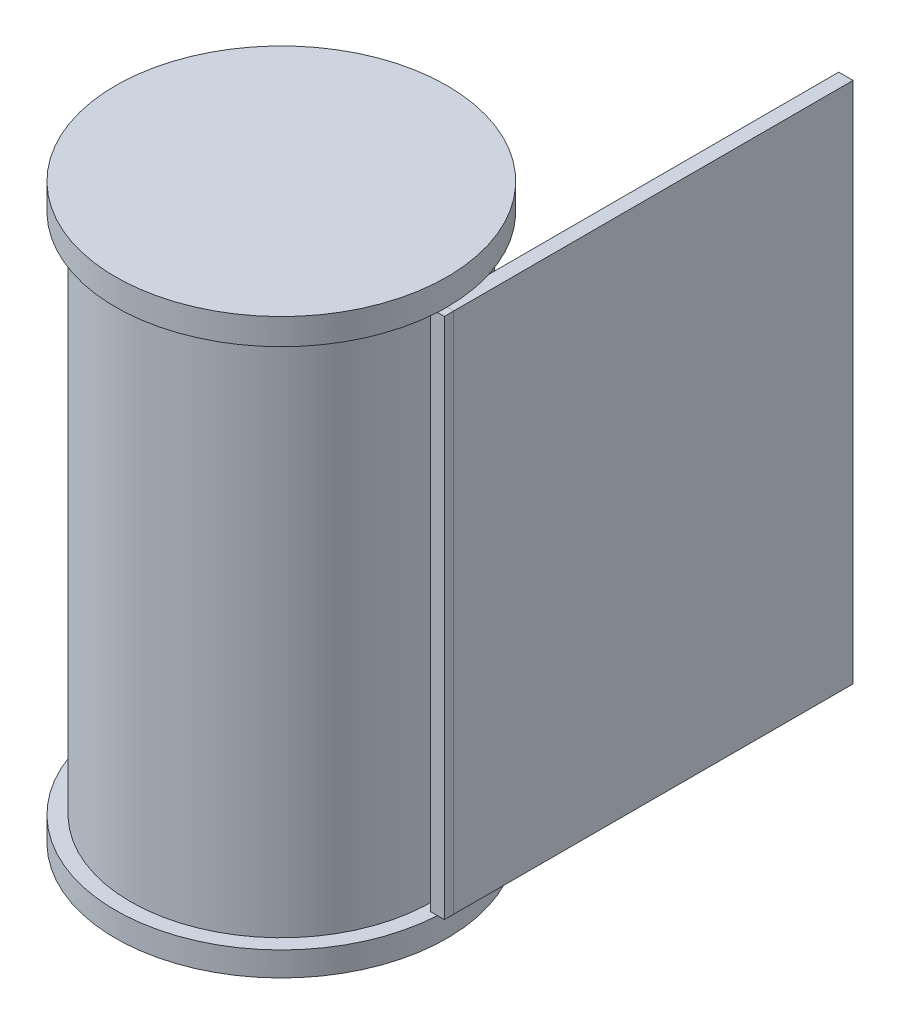
ISO-10303-21;
HEADER;
FILE_DESCRIPTION(('STEP AP214'),'2;1');
FILE_NAME('part.step','',(''),(''),'','','');
FILE_SCHEMA(('AUTOMOTIVE_DESIGN { 1 0 10303 214 1 1 1 1 }'));
ENDSEC;
DATA;
#1=APPLICATION_CONTEXT('core data for automotive mechanical design processes');
#2=APPLICATION_PROTOCOL_DEFINITION('international standard','automotive_design',2000,#1);
#3=PRODUCT_CONTEXT('',#1,'mechanical');
#4=PRODUCT('Part','Part','',(#3));
#5=PRODUCT_RELATED_PRODUCT_CATEGORY('part','',(#4));
#6=PRODUCT_DEFINITION_FORMATION('','',#4);
#7=PRODUCT_DEFINITION_CONTEXT('part definition',#1,'design');
#8=PRODUCT_DEFINITION('design','',#6,#7);
#9=PRODUCT_DEFINITION_SHAPE('','',#8);
#10=(LENGTH_UNIT() NAMED_UNIT(*) SI_UNIT(.MILLI.,.METRE.));
#11=(NAMED_UNIT(*) PLANE_ANGLE_UNIT() SI_UNIT($,.RADIAN.));
#12=(NAMED_UNIT(*) SI_UNIT($,.STERADIAN.) SOLID_ANGLE_UNIT());
#13=UNCERTAINTY_MEASURE_WITH_UNIT(LENGTH_MEASURE(1.E-05),#10,'distance_accuracy_value','');
#14=(GEOMETRIC_REPRESENTATION_CONTEXT(3) GLOBAL_UNCERTAINTY_ASSIGNED_CONTEXT((#13)) GLOBAL_UNIT_ASSIGNED_CONTEXT((#10,
#11,#12)) REPRESENTATION_CONTEXT('',''));
#15=CARTESIAN_POINT('',(0.,0.,0.));
#16=DIRECTION('',(0.,0.,1.));
#17=DIRECTION('',(1.,0.,0.));
#18=AXIS2_PLACEMENT_3D('',#15,#16,#17);
#19=CARTESIAN_POINT('',(0.,-64.2446613956254,0.));
#20=DIRECTION('',(0.,1.,0.));
#21=DIRECTION('',(0.,0.,1.));
#22=AXIS2_PLACEMENT_3D('',#19,#20,#21);
#23=PLANE('',#22);
#24=CARTESIAN_POINT('',(0.,-64.2446613956254,0.));
#25=DIRECTION('',(0.,-1.,0.));
#26=DIRECTION('',(0.,0.,-1.));
#27=AXIS2_PLACEMENT_3D('',#24,#25,#26);
#28=CIRCLE('',#27,32.1131733876922);
#29=CARTESIAN_POINT('',(0.,-64.2446613956254,-32.1131733876922));
#30=VERTEX_POINT('',#29);
#31=EDGE_CURVE('E185',#30,#30,#28,.T.);
#32=ORIENTED_EDGE('',*,*,#31,.T.);
#33=EDGE_LOOP('',(#32));
#34=FACE_BOUND('',#33,.T.);
#35=DIRECTION('',(1.,0.,0.));
#36=VECTOR('',#35,1.);
#37=CARTESIAN_POINT('',(36.7117632695279,-64.2446613956254,2.));
#38=LINE('',#37,#36);
#39=CARTESIAN_POINT('',(33.7117632695279,-64.2446613956254,2.));
#40=VERTEX_POINT('',#39);
#41=CARTESIAN_POINT('',(35.2346998319741,-64.2446613956254,2.));
#42=VERTEX_POINT('',#41);
#43=EDGE_CURVE('E60',#40,#42,#38,.T.);
#44=ORIENTED_EDGE('',*,*,#43,.F.);
#45=DIRECTION('',(0.,0.,-1.));
#46=VECTOR('',#45,1.);
#47=CARTESIAN_POINT('',(33.7117632695279,-64.2446613956254,2.));
#48=LINE('',#47,#46);
#49=CARTESIAN_POINT('',(33.7117632695279,-64.2446613956254,0.));
#50=VERTEX_POINT('',#49);
#51=EDGE_CURVE('E151',#40,#50,#48,.T.);
#52=ORIENTED_EDGE('',*,*,#51,.T.);
#53=DIRECTION('',(0.000314159260191267,0.,0.999999950651978));
#54=VECTOR('',#53,1.);
#55=CARTESIAN_POINT('',(33.7117599423104,-64.2446613956254,-0.0105908620858599));
#56=LINE('',#55,#54);
#57=CARTESIAN_POINT('',(33.7084800052616,-64.2446613956254,-10.4509544054214));
#58=VERTEX_POINT('',#57);
#59=EDGE_CURVE('E163',#58,#50,#56,.T.);
#60=ORIENTED_EDGE('',*,*,#59,.F.);
#61=CARTESIAN_POINT('',(0.,-64.2446613956254,0.));
#62=DIRECTION('',(0.,-1.,0.));
#63=DIRECTION('',(0.,0.,-1.));
#64=AXIS2_PLACEMENT_3D('',#61,#62,#63);
#65=CIRCLE('',#64,35.2914164103585);
#66=EDGE_CURVE('E188',#42,#58,#65,.T.);
#67=ORIENTED_EDGE('',*,*,#66,.F.);
#68=EDGE_LOOP('',(#44,#52,#60,#67));
#69=FACE_BOUND('',#68,.T.);
#70=ADVANCED_FACE('F37',(#34,#69),#23,.T.);
#71=CARTESIAN_POINT('',(0.,46.993844397693,0.));
#72=DIRECTION('',(0.,-1.,0.));
#73=DIRECTION('',(0.,0.,-1.));
#74=AXIS2_PLACEMENT_3D('',#71,#72,#73);
#75=PLANE('',#74);
#76=CARTESIAN_POINT('',(0.,46.993844397693,0.));
#77=DIRECTION('',(0.,-1.,0.));
#78=DIRECTION('',(0.,0.,-1.));
#79=AXIS2_PLACEMENT_3D('',#76,#77,#78);
#80=CIRCLE('',#79,32.1131733876922);
#81=CARTESIAN_POINT('',(0.,46.993844397693,-32.1131733876922));
#82=VERTEX_POINT('',#81);
#83=EDGE_CURVE('E182',#82,#82,#80,.T.);
#84=ORIENTED_EDGE('',*,*,#83,.F.);
#85=EDGE_LOOP('',(#84));
#86=FACE_BOUND('',#85,.T.);
#87=DIRECTION('',(-0.000314159260191267,0.,-0.999999950651978));
#88=VECTOR('',#87,1.);
#89=CARTESIAN_POINT('',(33.7117599423104,46.993844397693,-0.0105908620858599));
#90=LINE('',#89,#88);
#91=CARTESIAN_POINT('',(33.7117632695279,46.993844397693,0.));
#92=VERTEX_POINT('',#91);
#93=CARTESIAN_POINT('',(33.7084800052616,46.993844397693,-10.4509544054214));
#94=VERTEX_POINT('',#93);
#95=EDGE_CURVE('E160',#92,#94,#90,.T.);
#96=ORIENTED_EDGE('',*,*,#95,.F.);
#97=DIRECTION('',(0.,0.,-1.));
#98=VECTOR('',#97,1.);
#99=CARTESIAN_POINT('',(33.7117632695279,46.993844397693,2.));
#100=LINE('',#99,#98);
#101=CARTESIAN_POINT('',(33.7117632695279,46.993844397693,2.));
#102=VERTEX_POINT('',#101);
#103=EDGE_CURVE('E154',#102,#92,#100,.T.);
#104=ORIENTED_EDGE('',*,*,#103,.F.);
#105=DIRECTION('',(-1.,0.,0.));
#106=VECTOR('',#105,1.);
#107=CARTESIAN_POINT('',(33.7117632695279,46.993844397693,2.));
#108=LINE('',#107,#106);
#109=CARTESIAN_POINT('',(35.2346998319741,46.993844397693,2.));
#110=VERTEX_POINT('',#109);
#111=EDGE_CURVE('E147',#110,#102,#108,.T.);
#112=ORIENTED_EDGE('',*,*,#111,.F.);
#113=CARTESIAN_POINT('',(0.,46.993844397693,0.));
#114=DIRECTION('',(0.,-1.,0.));
#115=DIRECTION('',(0.,0.,-1.));
#116=AXIS2_PLACEMENT_3D('',#113,#114,#115);
#117=CIRCLE('',#116,35.2914164103585);
#118=EDGE_CURVE('E178',#110,#94,#117,.T.);
#119=ORIENTED_EDGE('',*,*,#118,.T.);
#120=EDGE_LOOP('',(#96,#104,#112,#119));
#121=FACE_BOUND('',#120,.T.);
#122=ADVANCED_FACE('F241',(#86,#121),#75,.T.);
#123=CARTESIAN_POINT('',(0.,52.5557696873589,0.));
#124=DIRECTION('',(0.,1.,0.));
#125=DIRECTION('',(0.,0.,1.));
#126=AXIS2_PLACEMENT_3D('',#123,#124,#125);
#127=PLANE('',#126);
#128=CARTESIAN_POINT('',(0.,52.5557696873589,0.));
#129=DIRECTION('',(0.,-1.,0.));
#130=DIRECTION('',(0.,0.,-1.));
#131=AXIS2_PLACEMENT_3D('',#128,#129,#130);
#132=CIRCLE('',#131,35.2914164103585);
#133=CARTESIAN_POINT('',(0.,52.5557696873589,-35.2914164103585));
#134=VERTEX_POINT('',#133);
#135=EDGE_CURVE('E175',#134,#134,#132,.T.);
#136=ORIENTED_EDGE('',*,*,#135,.F.);
#137=EDGE_LOOP('',(#136));
#138=FACE_BOUND('',#137,.T.);
#139=ADVANCED_FACE('F39',(#138),#127,.T.);
#140=CARTESIAN_POINT('',(0.,-69.409306307458,0.));
#141=DIRECTION('',(0.,-1.,0.));
#142=DIRECTION('',(0.,0.,-1.));
#143=AXIS2_PLACEMENT_3D('',#140,#141,#142);
#144=PLANE('',#143);
#145=CARTESIAN_POINT('',(0.,-69.409306307458,0.));
#146=DIRECTION('',(0.,-1.,0.));
#147=DIRECTION('',(0.,0.,-1.));
#148=AXIS2_PLACEMENT_3D('',#145,#146,#147);
#149=CIRCLE('',#148,22.1131733876922);
#150=CARTESIAN_POINT('',(0.,-69.409306307458,-22.1131733876922));
#151=VERTEX_POINT('',#150);
#152=EDGE_CURVE('E172',#151,#151,#149,.F.);
#153=ORIENTED_EDGE('',*,*,#152,.T.);
#154=EDGE_LOOP('',(#153));
#155=FACE_BOUND('',#154,.T.);
#156=CARTESIAN_POINT('',(0.,-69.409306307458,0.));
#157=DIRECTION('',(0.,-1.,0.));
#158=DIRECTION('',(0.,0.,-1.));
#159=AXIS2_PLACEMENT_3D('',#156,#157,#158);
#160=CIRCLE('',#159,35.2914164103585);
#161=CARTESIAN_POINT('',(0.,-69.409306307458,-35.2914164103585));
#162=VERTEX_POINT('',#161);
#163=EDGE_CURVE('E190',#162,#162,#160,.T.);
#164=ORIENTED_EDGE('',*,*,#163,.T.);
#165=EDGE_LOOP('',(#164));
#166=FACE_BOUND('',#165,.T.);
#167=ADVANCED_FACE('F268',(#155,#166),#144,.T.);
#168=CARTESIAN_POINT('',(0.,-77.4814163002232,0.));
#169=DIRECTION('',(0.,-1.,0.));
#170=DIRECTION('',(0.,0.,-1.));
#171=AXIS2_PLACEMENT_3D('',#168,#169,#170);
#172=CYLINDRICAL_SURFACE('',#171,35.2914164103585);
#173=CARTESIAN_POINT('',(0.,-64.2446613956254,0.));
#174=DIRECTION('',(0.,-0.999999950651978,0.000314159260191267));
#175=DIRECTION('',(0.,-0.000314159260191267,-0.999999950651978));
#176=AXIS2_PLACEMENT_3D('',#173,#174,#175);
#177=ELLIPSE('',#176,35.2914181519201,35.2914164103585);
#178=CARTESIAN_POINT('',(35.2914164103585,-64.2446613956254,0.));
#179=VERTEX_POINT('',#178);
#180=CARTESIAN_POINT('',(33.7084800052616,-64.2479446598917,-10.4509544054214));
#181=VERTEX_POINT('',#180);
#182=EDGE_CURVE('E167',#179,#181,#177,.F.);
#183=ORIENTED_EDGE('',*,*,#182,.F.);
#184=EDGE_CURVE('E124',#179,#42,#65,.T.);
#185=ORIENTED_EDGE('',*,*,#184,.T.);
#186=ORIENTED_EDGE('',*,*,#66,.T.);
#187=DIRECTION('',(0.,-1.,0.));
#188=VECTOR('',#187,1.);
#189=CARTESIAN_POINT('',(33.7084800052616,-77.4814163002232,-10.4509544054214));
#190=LINE('',#189,#188);
#191=EDGE_CURVE('E52',#181,#58,#190,.F.);
#192=ORIENTED_EDGE('',*,*,#191,.F.);
#193=EDGE_LOOP('',(#183,#185,#186,#192));
#194=FACE_BOUND('',#193,.T.);
#195=ORIENTED_EDGE('',*,*,#163,.F.);
#196=EDGE_LOOP('',(#195));
#197=FACE_BOUND('',#196,.T.);
#198=ADVANCED_FACE('F234',(#194,#197),#172,.T.);
#199=CARTESIAN_POINT('',(0.,-77.4814163002232,0.));
#200=DIRECTION('',(0.,-1.,0.));
#201=DIRECTION('',(0.,0.,-1.));
#202=AXIS2_PLACEMENT_3D('',#199,#200,#201);
#203=CYLINDRICAL_SURFACE('',#202,32.1131733876922);
#204=ORIENTED_EDGE('',*,*,#83,.T.);
#205=EDGE_LOOP('',(#204));
#206=FACE_BOUND('',#205,.T.);
#207=ORIENTED_EDGE('',*,*,#31,.F.);
#208=EDGE_LOOP('',(#207));
#209=FACE_BOUND('',#208,.T.);
#210=ADVANCED_FACE('F266',(#206,#209),#203,.T.);
#211=CARTESIAN_POINT('',(0.,-77.4814163002232,0.));
#212=DIRECTION('',(0.,-1.,0.));
#213=DIRECTION('',(0.,0.,-1.));
#214=AXIS2_PLACEMENT_3D('',#211,#212,#213);
#215=CYLINDRICAL_SURFACE('',#214,35.2914164103585);
#216=CARTESIAN_POINT('',(0.,46.993844397693,0.));
#217=DIRECTION('',(0.,0.999999950651978,0.000314159260191267));
#218=DIRECTION('',(0.,-0.000314159260191267,0.999999950651978));
#219=AXIS2_PLACEMENT_3D('',#216,#217,#218);
#220=ELLIPSE('',#219,35.2914181519201,35.2914164103585);
#221=CARTESIAN_POINT('',(33.7084800052616,46.9971276619594,-10.4509544054214));
#222=VERTEX_POINT('',#221);
#223=CARTESIAN_POINT('',(35.2914164103585,46.993844397693,0.));
#224=VERTEX_POINT('',#223);
#225=EDGE_CURVE('E11',#222,#224,#220,.F.);
#226=ORIENTED_EDGE('',*,*,#225,.F.);
#227=DIRECTION('',(0.,-1.,0.));
#228=VECTOR('',#227,1.);
#229=CARTESIAN_POINT('',(33.7084800052616,-77.4814163002232,-10.4509544054214));
#230=LINE('',#229,#228);
#231=EDGE_CURVE('E45',#94,#222,#230,.F.);
#232=ORIENTED_EDGE('',*,*,#231,.F.);
#233=ORIENTED_EDGE('',*,*,#118,.F.);
#234=EDGE_CURVE('E181',#224,#110,#117,.T.);
#235=ORIENTED_EDGE('',*,*,#234,.F.);
#236=EDGE_LOOP('',(#226,#232,#233,#235));
#237=FACE_BOUND('',#236,.T.);
#238=ORIENTED_EDGE('',*,*,#135,.T.);
#239=EDGE_LOOP('',(#238));
#240=FACE_BOUND('',#239,.T.);
#241=ADVANCED_FACE('F243',(#237,#240),#215,.T.);
#242=CARTESIAN_POINT('',(0.,-77.4814163002232,0.));
#243=DIRECTION('',(0.,-1.,0.));
#244=DIRECTION('',(0.,0.,-1.));
#245=AXIS2_PLACEMENT_3D('',#242,#243,#244);
#246=CYLINDRICAL_SURFACE('',#245,22.1131733876922);
#247=CARTESIAN_POINT('',(0.,42.5557696873589,0.));
#248=DIRECTION('',(0.,1.,0.));
#249=DIRECTION('',(0.,0.,1.));
#250=AXIS2_PLACEMENT_3D('',#247,#248,#249);
#251=CIRCLE('',#250,22.1131733876922);
#252=CARTESIAN_POINT('',(0.,42.5557696873589,22.1131733876922));
#253=VERTEX_POINT('',#252);
#254=EDGE_CURVE('E169',#253,#253,#251,.T.);
#255=ORIENTED_EDGE('',*,*,#254,.T.);
#256=EDGE_LOOP('',(#255));
#257=FACE_BOUND('',#256,.T.);
#258=ORIENTED_EDGE('',*,*,#152,.F.);
#259=EDGE_LOOP('',(#258));
#260=FACE_BOUND('',#259,.T.);
#261=ADVANCED_FACE('F279',(#257,#260),#246,.F.);
#262=CARTESIAN_POINT('',(0.,42.5557696873589,0.));
#263=DIRECTION('',(0.,1.,0.));
#264=DIRECTION('',(0.,0.,1.));
#265=AXIS2_PLACEMENT_3D('',#262,#263,#264);
#266=PLANE('',#265);
#267=ORIENTED_EDGE('',*,*,#254,.F.);
#268=EDGE_LOOP('',(#267));
#269=FACE_BOUND('',#268,.T.);
#270=ADVANCED_FACE('F281',(#269),#266,.F.);
#271=CARTESIAN_POINT('',(33.7117632695279,46.993844397693,2.));
#272=DIRECTION('',(0.,-1.,0.));
#273=DIRECTION('',(0.,0.,-1.));
#274=AXIS2_PLACEMENT_3D('',#271,#272,#273);
#275=PLANE('',#274);
#276=ORIENTED_EDGE('',*,*,#234,.T.);
#277=CARTESIAN_POINT('',(36.7117632695279,46.993844397693,2.));
#278=VERTEX_POINT('',#277);
#279=EDGE_CURVE('E219',#278,#110,#108,.T.);
#280=ORIENTED_EDGE('',*,*,#279,.F.);
#281=DIRECTION('',(0.,0.,-1.));
#282=VECTOR('',#281,1.);
#283=CARTESIAN_POINT('',(36.7117632695279,46.993844397693,2.));
#284=LINE('',#283,#282);
#285=CARTESIAN_POINT('',(36.7117632695279,46.993844397693,0.));
#286=VERTEX_POINT('',#285);
#287=EDGE_CURVE('E152',#278,#286,#284,.T.);
#288=ORIENTED_EDGE('',*,*,#287,.T.);
#289=DIRECTION('',(-1.,0.,0.));
#290=VECTOR('',#289,1.);
#291=CARTESIAN_POINT('',(33.7117632695279,46.993844397693,0.));
#292=LINE('',#291,#290);
#293=EDGE_CURVE('E227',#286,#224,#292,.T.);
#294=ORIENTED_EDGE('',*,*,#293,.T.);
#295=EDGE_LOOP('',(#276,#280,#288,#294));
#296=FACE_BOUND('',#295,.T.);
#297=ADVANCED_FACE('F246',(#296),#275,.F.);
#298=CARTESIAN_POINT('',(33.7117632695279,46.993844397693,2.));
#299=DIRECTION('',(1.,0.,0.));
#300=DIRECTION('',(0.,1.,0.));
#301=AXIS2_PLACEMENT_3D('',#298,#299,#300);
#302=PLANE('',#301);
#303=DIRECTION('',(0.,-1.,0.));
#304=VECTOR('',#303,1.);
#305=CARTESIAN_POINT('',(33.7117632695279,46.993844397693,0.));
#306=LINE('',#305,#304);
#307=EDGE_CURVE('E127',#92,#50,#306,.T.);
#308=ORIENTED_EDGE('',*,*,#307,.T.);
#309=ORIENTED_EDGE('',*,*,#51,.F.);
#310=DIRECTION('',(0.,-1.,0.));
#311=VECTOR('',#310,1.);
#312=CARTESIAN_POINT('',(33.7117632695279,46.993844397693,2.));
#313=LINE('',#312,#311);
#314=EDGE_CURVE('E222',#102,#40,#313,.T.);
#315=ORIENTED_EDGE('',*,*,#314,.F.);
#316=ORIENTED_EDGE('',*,*,#103,.T.);
#317=EDGE_LOOP('',(#308,#309,#315,#316));
#318=FACE_BOUND('',#317,.T.);
#319=ADVANCED_FACE('F232',(#318),#302,.F.);
#320=CARTESIAN_POINT('',(36.7117632695279,-64.2446613956254,2.));
#321=DIRECTION('',(0.,1.,0.));
#322=DIRECTION('',(0.,0.,1.));
#323=AXIS2_PLACEMENT_3D('',#320,#321,#322);
#324=PLANE('',#323);
#325=ORIENTED_EDGE('',*,*,#184,.F.);
#326=DIRECTION('',(1.,0.,0.));
#327=VECTOR('',#326,1.);
#328=CARTESIAN_POINT('',(36.7117632695279,-64.2446613956254,0.));
#329=LINE('',#328,#327);
#330=CARTESIAN_POINT('',(36.7117632695279,-64.2446613956254,0.));
#331=VERTEX_POINT('',#330);
#332=EDGE_CURVE('E116',#179,#331,#329,.T.);
#333=ORIENTED_EDGE('',*,*,#332,.T.);
#334=DIRECTION('',(0.,0.,-1.));
#335=VECTOR('',#334,1.);
#336=CARTESIAN_POINT('',(36.7117632695279,-64.2446613956254,2.));
#337=LINE('',#336,#335);
#338=CARTESIAN_POINT('',(36.7117632695279,-64.2446613956254,2.));
#339=VERTEX_POINT('',#338);
#340=EDGE_CURVE('E121',#339,#331,#337,.T.);
#341=ORIENTED_EDGE('',*,*,#340,.F.);
#342=EDGE_CURVE('E224',#42,#339,#38,.T.);
#343=ORIENTED_EDGE('',*,*,#342,.F.);
#344=EDGE_LOOP('',(#325,#333,#341,#343));
#345=FACE_BOUND('',#344,.T.);
#346=ADVANCED_FACE('F118',(#345),#324,.F.);
#347=CARTESIAN_POINT('',(36.7117632695279,46.993844397693,2.));
#348=DIRECTION('',(-1.,0.,0.));
#349=DIRECTION('',(0.,-1.,0.));
#350=AXIS2_PLACEMENT_3D('',#347,#348,#349);
#351=PLANE('',#350);
#352=DIRECTION('',(0.,1.,0.));
#353=VECTOR('',#352,1.);
#354=CARTESIAN_POINT('',(36.7117632695279,46.993844397693,0.));
#355=LINE('',#354,#353);
#356=EDGE_CURVE('E126',#331,#286,#355,.T.);
#357=ORIENTED_EDGE('',*,*,#356,.T.);
#358=ORIENTED_EDGE('',*,*,#287,.F.);
#359=DIRECTION('',(0.,1.,0.));
#360=VECTOR('',#359,1.);
#361=CARTESIAN_POINT('',(36.7117632695279,46.993844397693,2.));
#362=LINE('',#361,#360);
#363=EDGE_CURVE('E150',#339,#278,#362,.T.);
#364=ORIENTED_EDGE('',*,*,#363,.F.);
#365=ORIENTED_EDGE('',*,*,#340,.T.);
#366=EDGE_LOOP('',(#357,#358,#364,#365));
#367=FACE_BOUND('',#366,.T.);
#368=ADVANCED_FACE('F149',(#367),#351,.F.);
#369=CARTESIAN_POINT('',(0.,0.,2.));
#370=DIRECTION('',(0.,0.,-1.));
#371=DIRECTION('',(-1.,0.,0.));
#372=AXIS2_PLACEMENT_3D('',#369,#370,#371);
#373=PLANE('',#372);
#374=ORIENTED_EDGE('',*,*,#279,.T.);
#375=ORIENTED_EDGE('',*,*,#111,.T.);
#376=ORIENTED_EDGE('',*,*,#314,.T.);
#377=ORIENTED_EDGE('',*,*,#43,.T.);
#378=ORIENTED_EDGE('',*,*,#342,.T.);
#379=ORIENTED_EDGE('',*,*,#363,.T.);
#380=EDGE_LOOP('',(#374,#375,#376,#377,#378,#379));
#381=FACE_BOUND('',#380,.T.);
#382=ADVANCED_FACE('F237',(#381),#373,.F.);
#383=CARTESIAN_POINT('',(33.7117632695279,46.993844397693,0.));
#384=DIRECTION('',(0.,0.999999950651978,0.000314159260191267));
#385=DIRECTION('',(0.,-0.000314159260191267,0.999999950651978));
#386=AXIS2_PLACEMENT_3D('',#383,#384,#385);
#387=PLANE('',#386);
#388=DIRECTION('',(0.000314159244688131,-0.000314159244688131,0.999999901303964));
#389=VECTOR('',#388,1.);
#390=CARTESIAN_POINT('',(33.7117632695279,46.993844397693,0.));
#391=LINE('',#390,#389);
#392=CARTESIAN_POINT('',(33.6850597310939,47.0205479361271,-85.));
#393=VERTEX_POINT('',#392);
#394=EDGE_CURVE('E198',#393,#222,#391,.T.);
#395=ORIENTED_EDGE('',*,*,#394,.T.);
#396=ORIENTED_EDGE('',*,*,#225,.T.);
#397=ORIENTED_EDGE('',*,*,#293,.F.);
#398=DIRECTION('',(-0.000314159244688131,-0.000314159244688131,0.999999901303964));
#399=VECTOR('',#398,1.);
#400=CARTESIAN_POINT('',(36.7117632695279,46.993844397693,0.));
#401=LINE('',#400,#399);
#402=CARTESIAN_POINT('',(36.7384668079619,47.0205479361271,-85.));
#403=VERTEX_POINT('',#402);
#404=EDGE_CURVE('E138',#403,#286,#401,.T.);
#405=ORIENTED_EDGE('',*,*,#404,.F.);
#406=DIRECTION('',(-1.,0.,0.));
#407=VECTOR('',#406,1.);
#408=CARTESIAN_POINT('',(33.7117632695279,47.0205479361271,-85.));
#409=LINE('',#408,#407);
#410=EDGE_CURVE('E208',#403,#393,#409,.T.);
#411=ORIENTED_EDGE('',*,*,#410,.T.);
#412=EDGE_LOOP('',(#395,#396,#397,#405,#411));
#413=FACE_BOUND('',#412,.T.);
#414=ADVANCED_FACE('F205',(#413),#387,.T.);
#415=CARTESIAN_POINT('',(36.7117632695279,46.993844397693,0.));
#416=DIRECTION('',(0.999999950651978,0.,0.000314159260191267));
#417=DIRECTION('',(0.000314159260191267,0.,-0.999999950651978));
#418=AXIS2_PLACEMENT_3D('',#415,#416,#417);
#419=PLANE('',#418);
#420=ORIENTED_EDGE('',*,*,#356,.F.);
#421=DIRECTION('',(-0.000314159244688131,0.000314159244688131,0.999999901303964));
#422=VECTOR('',#421,1.);
#423=CARTESIAN_POINT('',(36.7117632695279,-64.2446613956254,0.));
#424=LINE('',#423,#422);
#425=CARTESIAN_POINT('',(36.7384668079619,-64.2713649340594,-85.));
#426=VERTEX_POINT('',#425);
#427=EDGE_CURVE('E130',#426,#331,#424,.T.);
#428=ORIENTED_EDGE('',*,*,#427,.F.);
#429=DIRECTION('',(0.,1.,0.));
#430=VECTOR('',#429,1.);
#431=CARTESIAN_POINT('',(36.7384668079619,46.993844397693,-85.));
#432=LINE('',#431,#430);
#433=EDGE_CURVE('E209',#426,#403,#432,.T.);
#434=ORIENTED_EDGE('',*,*,#433,.T.);
#435=ORIENTED_EDGE('',*,*,#404,.T.);
#436=EDGE_LOOP('',(#420,#428,#434,#435));
#437=FACE_BOUND('',#436,.T.);
#438=ADVANCED_FACE('F142',(#437),#419,.T.);
#439=CARTESIAN_POINT('',(36.7117632695279,-64.2446613956254,0.));
#440=DIRECTION('',(0.,-0.999999950651978,0.000314159260191267));
#441=DIRECTION('',(0.,-0.000314159260191267,-0.999999950651978));
#442=AXIS2_PLACEMENT_3D('',#439,#440,#441);
#443=PLANE('',#442);
#444=ORIENTED_EDGE('',*,*,#332,.F.);
#445=ORIENTED_EDGE('',*,*,#182,.T.);
#446=DIRECTION('',(0.000314159244688131,0.000314159244688131,0.999999901303964));
#447=VECTOR('',#446,1.);
#448=CARTESIAN_POINT('',(33.7117742483269,-64.2446504168264,0.0349466015111738));
#449=LINE('',#448,#447);
#450=CARTESIAN_POINT('',(33.6850597310939,-64.2713649340594,-85.));
#451=VERTEX_POINT('',#450);
#452=EDGE_CURVE('E139',#451,#181,#449,.T.);
#453=ORIENTED_EDGE('',*,*,#452,.F.);
#454=DIRECTION('',(1.,0.,0.));
#455=VECTOR('',#454,1.);
#456=CARTESIAN_POINT('',(36.7117632695279,-64.2713649340594,-85.));
#457=LINE('',#456,#455);
#458=EDGE_CURVE('E134',#451,#426,#457,.T.);
#459=ORIENTED_EDGE('',*,*,#458,.T.);
#460=ORIENTED_EDGE('',*,*,#427,.T.);
#461=EDGE_LOOP('',(#444,#445,#453,#459,#460));
#462=FACE_BOUND('',#461,.T.);
#463=ADVANCED_FACE('F132',(#462),#443,.T.);
#464=CARTESIAN_POINT('',(33.7117632695279,46.993844397693,0.));
#465=DIRECTION('',(-0.999999950651978,0.,0.000314159260191267));
#466=DIRECTION('',(0.000314159260191267,0.,0.999999950651978));
#467=AXIS2_PLACEMENT_3D('',#464,#465,#466);
#468=PLANE('',#467);
#469=ORIENTED_EDGE('',*,*,#452,.T.);
#470=ORIENTED_EDGE('',*,*,#191,.T.);
#471=ORIENTED_EDGE('',*,*,#59,.T.);
#472=ORIENTED_EDGE('',*,*,#307,.F.);
#473=ORIENTED_EDGE('',*,*,#95,.T.);
#474=ORIENTED_EDGE('',*,*,#231,.T.);
#475=ORIENTED_EDGE('',*,*,#394,.F.);
#476=DIRECTION('',(0.,-1.,0.));
#477=VECTOR('',#476,1.);
#478=CARTESIAN_POINT('',(33.6850597310939,46.993844397693,-85.));
#479=LINE('',#478,#477);
#480=EDGE_CURVE('E215',#393,#451,#479,.T.);
#481=ORIENTED_EDGE('',*,*,#480,.T.);
#482=EDGE_LOOP('',(#469,#470,#471,#472,#473,#474,#475,#481));
#483=FACE_BOUND('',#482,.T.);
#484=ADVANCED_FACE('F196',(#483),#468,.T.);
#485=CARTESIAN_POINT('',(0.,0.,-85.));
#486=DIRECTION('',(0.,0.,-1.));
#487=DIRECTION('',(-1.,0.,0.));
#488=AXIS2_PLACEMENT_3D('',#485,#486,#487);
#489=PLANE('',#488);
#490=ORIENTED_EDGE('',*,*,#410,.F.);
#491=ORIENTED_EDGE('',*,*,#433,.F.);
#492=ORIENTED_EDGE('',*,*,#458,.F.);
#493=ORIENTED_EDGE('',*,*,#480,.F.);
#494=EDGE_LOOP('',(#490,#491,#492,#493));
#495=FACE_BOUND('',#494,.T.);
#496=ADVANCED_FACE('F248',(#495),#489,.T.);
#497=CLOSED_SHELL('',(#70,#122,#139,#167,#198,#210,#241,#261,#270,#297,#319,#346,#368,#382,#414,
#438,#463,#484,#496));
#498=MANIFOLD_SOLID_BREP('B2',#497);
#499=ADVANCED_BREP_SHAPE_REPRESENTATION('',(#18,#498),#14);
#500=SHAPE_DEFINITION_REPRESENTATION(#9,#499);
ENDSEC;
END-ISO-10303-21;
